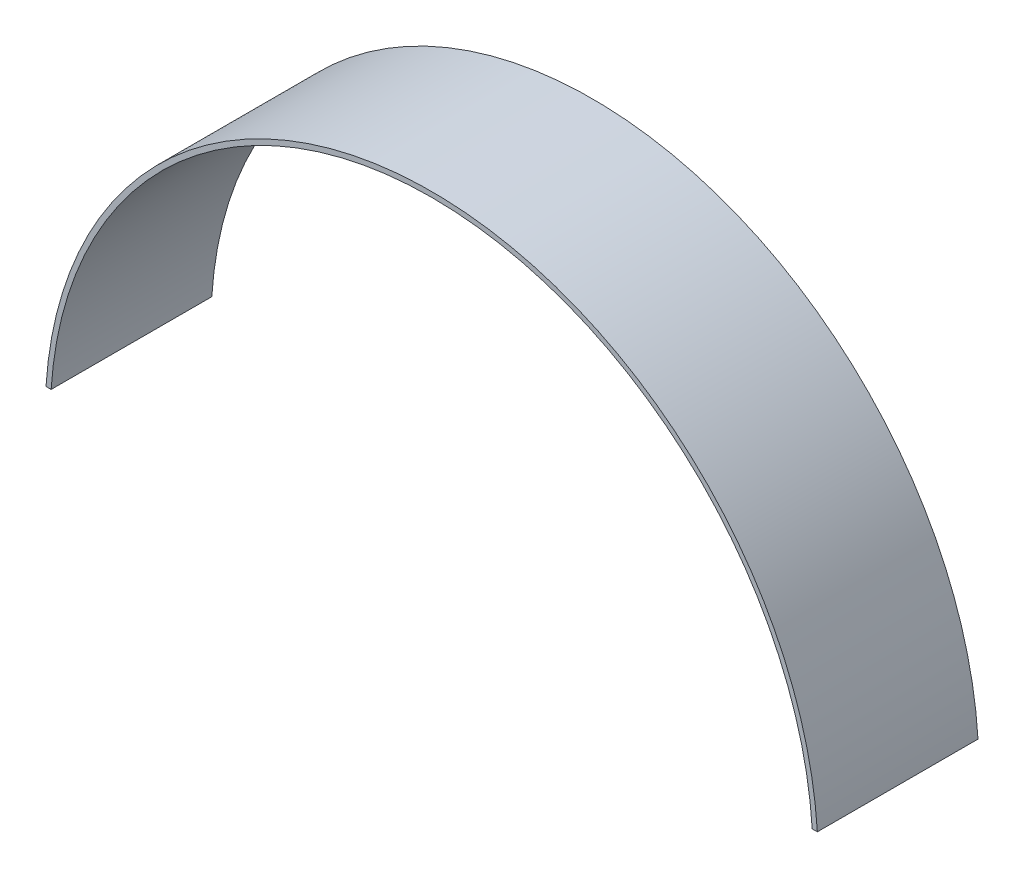
ISO-10303-21;
HEADER;
FILE_DESCRIPTION(('STEP AP214'),'2;1');
FILE_NAME('part.step','',(''),(''),'','','');
FILE_SCHEMA(('AUTOMOTIVE_DESIGN { 1 0 10303 214 1 1 1 1 }'));
ENDSEC;
DATA;
#1=APPLICATION_CONTEXT('core data for automotive mechanical design processes');
#2=APPLICATION_PROTOCOL_DEFINITION('international standard','automotive_design',2000,#1);
#3=PRODUCT_CONTEXT('',#1,'mechanical');
#4=PRODUCT('Part','Part','',(#3));
#5=PRODUCT_RELATED_PRODUCT_CATEGORY('part','',(#4));
#6=PRODUCT_DEFINITION_FORMATION('','',#4);
#7=PRODUCT_DEFINITION_CONTEXT('part definition',#1,'design');
#8=PRODUCT_DEFINITION('design','',#6,#7);
#9=PRODUCT_DEFINITION_SHAPE('','',#8);
#10=(LENGTH_UNIT() NAMED_UNIT(*) SI_UNIT(.MILLI.,.METRE.));
#11=(NAMED_UNIT(*) PLANE_ANGLE_UNIT() SI_UNIT($,.RADIAN.));
#12=(NAMED_UNIT(*) SI_UNIT($,.STERADIAN.) SOLID_ANGLE_UNIT());
#13=UNCERTAINTY_MEASURE_WITH_UNIT(LENGTH_MEASURE(1.E-05),#10,'distance_accuracy_value','');
#14=(GEOMETRIC_REPRESENTATION_CONTEXT(3) GLOBAL_UNCERTAINTY_ASSIGNED_CONTEXT((#13)) GLOBAL_UNIT_ASSIGNED_CONTEXT((#10,
#11,#12)) REPRESENTATION_CONTEXT('',''));
#15=CARTESIAN_POINT('',(0.,0.,0.));
#16=DIRECTION('',(0.,0.,1.));
#17=DIRECTION('',(1.,0.,0.));
#18=AXIS2_PLACEMENT_3D('',#15,#16,#17);
#19=CARTESIAN_POINT('',(0.,4.61076413342446,30.));
#20=DIRECTION('',(0.,1.,0.));
#21=DIRECTION('',(0.,0.,1.));
#22=AXIS2_PLACEMENT_3D('',#19,#20,#21);
#23=PLANE('',#22);
#24=DIRECTION('',(1.,0.,0.));
#25=VECTOR('',#24,1.);
#26=CARTESIAN_POINT('',(0.,4.61076413342446,0.));
#27=LINE('',#26,#25);
#28=CARTESIAN_POINT('',(71.0625299745735,4.61076413342446,0.));
#29=VERTEX_POINT('',#28);
#30=CARTESIAN_POINT('',(72.0188237718478,4.61076413342446,0.));
#31=VERTEX_POINT('',#30);
#32=EDGE_CURVE('E97',#29,#31,#27,.T.);
#33=ORIENTED_EDGE('',*,*,#32,.T.);
#34=DIRECTION('',(0.,0.,-1.));
#35=VECTOR('',#34,1.);
#36=CARTESIAN_POINT('',(72.0188237718478,4.61076413342446,30.));
#37=LINE('',#36,#35);
#38=CARTESIAN_POINT('',(72.0188237718478,4.61076413342446,30.));
#39=VERTEX_POINT('',#38);
#40=EDGE_CURVE('E11',#39,#31,#37,.T.);
#41=ORIENTED_EDGE('',*,*,#40,.F.);
#42=DIRECTION('',(1.,0.,0.));
#43=VECTOR('',#42,1.);
#44=CARTESIAN_POINT('',(0.,4.61076413342446,30.));
#45=LINE('',#44,#43);
#46=CARTESIAN_POINT('',(71.0625299745735,4.61076413342446,30.));
#47=VERTEX_POINT('',#46);
#48=EDGE_CURVE('E83',#47,#39,#45,.T.);
#49=ORIENTED_EDGE('',*,*,#48,.F.);
#50=DIRECTION('',(0.,0.,-1.));
#51=VECTOR('',#50,1.);
#52=CARTESIAN_POINT('',(71.0625299745735,4.61076413342446,30.));
#53=LINE('',#52,#51);
#54=EDGE_CURVE('E50',#47,#29,#53,.T.);
#55=ORIENTED_EDGE('',*,*,#54,.T.);
#56=EDGE_LOOP('',(#33,#41,#49,#55));
#57=FACE_BOUND('',#56,.T.);
#58=ADVANCED_FACE('F34',(#57),#23,.F.);
#59=CARTESIAN_POINT('',(0.,0.,30.));
#60=DIRECTION('',(0.,0.,-1.));
#61=DIRECTION('',(-1.,0.,0.));
#62=AXIS2_PLACEMENT_3D('',#59,#60,#61);
#63=CYLINDRICAL_SURFACE('',#62,72.1662672124209);
#64=CARTESIAN_POINT('',(0.,0.,0.));
#65=DIRECTION('',(0.,0.,1.));
#66=DIRECTION('',(1.,0.,0.));
#67=AXIS2_PLACEMENT_3D('',#64,#65,#66);
#68=CIRCLE('',#67,72.1662672124209);
#69=CARTESIAN_POINT('',(-72.0188237718478,4.61076413342446,0.));
#70=VERTEX_POINT('',#69);
#71=EDGE_CURVE('E88',#31,#70,#68,.T.);
#72=ORIENTED_EDGE('',*,*,#71,.T.);
#73=DIRECTION('',(0.,0.,-1.));
#74=VECTOR('',#73,1.);
#75=CARTESIAN_POINT('',(-72.0188237718478,4.61076413342446,30.));
#76=LINE('',#75,#74);
#77=CARTESIAN_POINT('',(-72.0188237718478,4.61076413342446,30.));
#78=VERTEX_POINT('',#77);
#79=EDGE_CURVE('E42',#78,#70,#76,.T.);
#80=ORIENTED_EDGE('',*,*,#79,.F.);
#81=CARTESIAN_POINT('',(0.,0.,30.));
#82=DIRECTION('',(0.,0.,1.));
#83=DIRECTION('',(1.,0.,0.));
#84=AXIS2_PLACEMENT_3D('',#81,#82,#83);
#85=CIRCLE('',#84,72.1662672124209);
#86=EDGE_CURVE('E76',#39,#78,#85,.T.);
#87=ORIENTED_EDGE('',*,*,#86,.F.);
#88=ORIENTED_EDGE('',*,*,#40,.T.);
#89=EDGE_LOOP('',(#72,#80,#87,#88));
#90=FACE_BOUND('',#89,.T.);
#91=ADVANCED_FACE('F87',(#90),#63,.T.);
#92=CARTESIAN_POINT('',(0.,4.61076413342446,30.));
#93=DIRECTION('',(0.,1.,0.));
#94=DIRECTION('',(0.,0.,1.));
#95=AXIS2_PLACEMENT_3D('',#92,#93,#94);
#96=PLANE('',#95);
#97=DIRECTION('',(1.,0.,0.));
#98=VECTOR('',#97,1.);
#99=CARTESIAN_POINT('',(0.,4.61076413342446,0.));
#100=LINE('',#99,#98);
#101=CARTESIAN_POINT('',(-71.0625299745735,4.61076413342446,0.));
#102=VERTEX_POINT('',#101);
#103=EDGE_CURVE('E100',#70,#102,#100,.T.);
#104=ORIENTED_EDGE('',*,*,#103,.T.);
#105=DIRECTION('',(0.,0.,-1.));
#106=VECTOR('',#105,1.);
#107=CARTESIAN_POINT('',(-71.0625299745735,4.61076413342446,30.));
#108=LINE('',#107,#106);
#109=CARTESIAN_POINT('',(-71.0625299745735,4.61076413342446,30.));
#110=VERTEX_POINT('',#109);
#111=EDGE_CURVE('E65',#110,#102,#108,.T.);
#112=ORIENTED_EDGE('',*,*,#111,.F.);
#113=DIRECTION('',(1.,0.,0.));
#114=VECTOR('',#113,1.);
#115=CARTESIAN_POINT('',(0.,4.61076413342446,30.));
#116=LINE('',#115,#114);
#117=EDGE_CURVE('E82',#78,#110,#116,.T.);
#118=ORIENTED_EDGE('',*,*,#117,.F.);
#119=ORIENTED_EDGE('',*,*,#79,.T.);
#120=EDGE_LOOP('',(#104,#112,#118,#119));
#121=FACE_BOUND('',#120,.T.);
#122=ADVANCED_FACE('F91',(#121),#96,.F.);
#123=CARTESIAN_POINT('',(0.,0.,30.));
#124=DIRECTION('',(0.,0.,-1.));
#125=DIRECTION('',(-1.,0.,0.));
#126=AXIS2_PLACEMENT_3D('',#123,#124,#125);
#127=CYLINDRICAL_SURFACE('',#126,71.2119534367737);
#128=CARTESIAN_POINT('',(0.,0.,0.));
#129=DIRECTION('',(0.,0.,1.));
#130=DIRECTION('',(1.,0.,0.));
#131=AXIS2_PLACEMENT_3D('',#128,#129,#130);
#132=CIRCLE('',#131,71.2119534367737);
#133=EDGE_CURVE('E102',#29,#102,#132,.T.);
#134=ORIENTED_EDGE('',*,*,#133,.F.);
#135=ORIENTED_EDGE('',*,*,#54,.F.);
#136=CARTESIAN_POINT('',(0.,0.,30.));
#137=DIRECTION('',(0.,0.,1.));
#138=DIRECTION('',(1.,0.,0.));
#139=AXIS2_PLACEMENT_3D('',#136,#137,#138);
#140=CIRCLE('',#139,71.2119534367737);
#141=EDGE_CURVE('E92',#47,#110,#140,.T.);
#142=ORIENTED_EDGE('',*,*,#141,.T.);
#143=ORIENTED_EDGE('',*,*,#111,.T.);
#144=EDGE_LOOP('',(#134,#135,#142,#143));
#145=FACE_BOUND('',#144,.T.);
#146=ADVANCED_FACE('F108',(#145),#127,.F.);
#147=CARTESIAN_POINT('',(0.,0.,30.));
#148=DIRECTION('',(0.,0.,1.));
#149=DIRECTION('',(1.,0.,0.));
#150=AXIS2_PLACEMENT_3D('',#147,#148,#149);
#151=PLANE('',#150);
#152=ORIENTED_EDGE('',*,*,#48,.T.);
#153=ORIENTED_EDGE('',*,*,#86,.T.);
#154=ORIENTED_EDGE('',*,*,#117,.T.);
#155=ORIENTED_EDGE('',*,*,#141,.F.);
#156=EDGE_LOOP('',(#152,#153,#154,#155));
#157=FACE_BOUND('',#156,.T.);
#158=ADVANCED_FACE('F79',(#157),#151,.T.);
#159=CARTESIAN_POINT('',(0.,0.,0.));
#160=DIRECTION('',(0.,0.,1.));
#161=DIRECTION('',(1.,0.,0.));
#162=AXIS2_PLACEMENT_3D('',#159,#160,#161);
#163=PLANE('',#162);
#164=ORIENTED_EDGE('',*,*,#32,.F.);
#165=ORIENTED_EDGE('',*,*,#133,.T.);
#166=ORIENTED_EDGE('',*,*,#103,.F.);
#167=ORIENTED_EDGE('',*,*,#71,.F.);
#168=EDGE_LOOP('',(#164,#165,#166,#167));
#169=FACE_BOUND('',#168,.T.);
#170=ADVANCED_FACE('F107',(#169),#163,.F.);
#171=CLOSED_SHELL('',(#58,#91,#122,#146,#158,#170));
#172=MANIFOLD_SOLID_BREP('B2',#171);
#173=ADVANCED_BREP_SHAPE_REPRESENTATION('',(#18,#172),#14);
#174=SHAPE_DEFINITION_REPRESENTATION(#9,#173);
ENDSEC;
END-ISO-10303-21;
